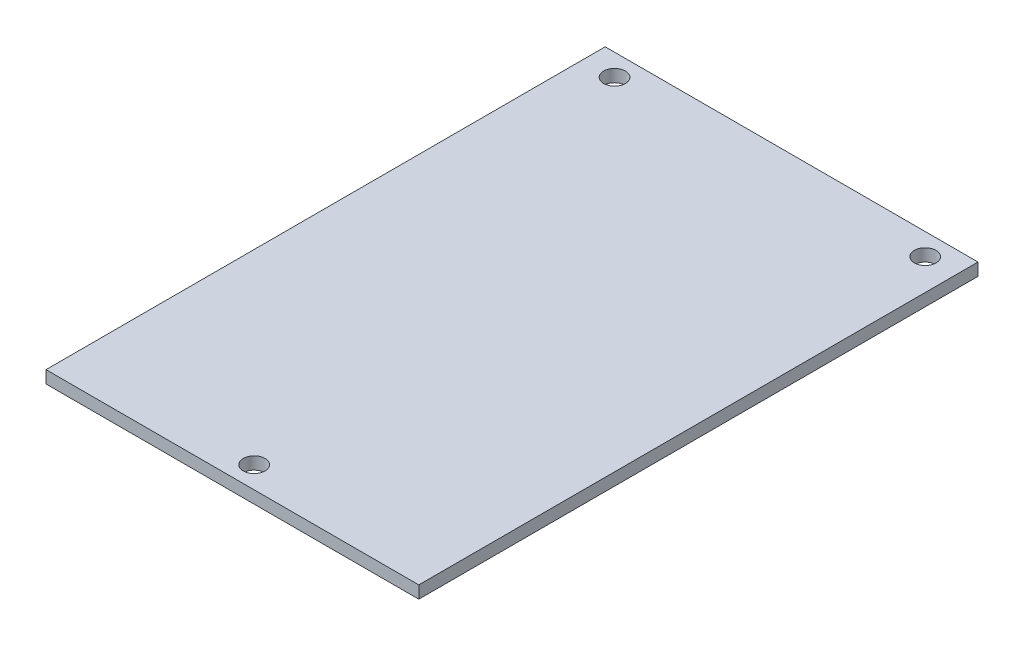
ISO-10303-21;
HEADER;
FILE_DESCRIPTION(('STEP AP214'),'2;1');
FILE_NAME('part.step','',(''),(''),'','','');
FILE_SCHEMA(('AUTOMOTIVE_DESIGN { 1 0 10303 214 1 1 1 1 }'));
ENDSEC;
DATA;
#1=APPLICATION_CONTEXT('core data for automotive mechanical design processes');
#2=APPLICATION_PROTOCOL_DEFINITION('international standard','automotive_design',2000,#1);
#3=PRODUCT_CONTEXT('',#1,'mechanical');
#4=PRODUCT('Part','Part','',(#3));
#5=PRODUCT_RELATED_PRODUCT_CATEGORY('part','',(#4));
#6=PRODUCT_DEFINITION_FORMATION('','',#4);
#7=PRODUCT_DEFINITION_CONTEXT('part definition',#1,'design');
#8=PRODUCT_DEFINITION('design','',#6,#7);
#9=PRODUCT_DEFINITION_SHAPE('','',#8);
#10=(LENGTH_UNIT() NAMED_UNIT(*) SI_UNIT(.MILLI.,.METRE.));
#11=(NAMED_UNIT(*) PLANE_ANGLE_UNIT() SI_UNIT($,.RADIAN.));
#12=(NAMED_UNIT(*) SI_UNIT($,.STERADIAN.) SOLID_ANGLE_UNIT());
#13=UNCERTAINTY_MEASURE_WITH_UNIT(LENGTH_MEASURE(1.E-05),#10,'distance_accuracy_value','');
#14=(GEOMETRIC_REPRESENTATION_CONTEXT(3) GLOBAL_UNCERTAINTY_ASSIGNED_CONTEXT((#13)) GLOBAL_UNIT_ASSIGNED_CONTEXT((#10,
#11,#12)) REPRESENTATION_CONTEXT('',''));
#15=CARTESIAN_POINT('',(0.,0.,0.));
#16=DIRECTION('',(0.,0.,1.));
#17=DIRECTION('',(1.,0.,0.));
#18=AXIS2_PLACEMENT_3D('',#15,#16,#17);
#19=CARTESIAN_POINT('',(30.,2.,-45.));
#20=DIRECTION('',(-1.,0.,0.));
#21=DIRECTION('',(0.,0.,1.));
#22=AXIS2_PLACEMENT_3D('',#19,#20,#21);
#23=PLANE('',#22);
#24=DIRECTION('',(0.,0.,-1.));
#25=VECTOR('',#24,1.);
#26=CARTESIAN_POINT('',(30.,0.,-45.));
#27=LINE('',#26,#25);
#28=CARTESIAN_POINT('',(30.,0.,45.));
#29=VERTEX_POINT('',#28);
#30=CARTESIAN_POINT('',(30.,0.,-45.));
#31=VERTEX_POINT('',#30);
#32=EDGE_CURVE('E96',#29,#31,#27,.T.);
#33=ORIENTED_EDGE('',*,*,#32,.T.);
#34=DIRECTION('',(0.,-1.,0.));
#35=VECTOR('',#34,1.);
#36=CARTESIAN_POINT('',(30.,2.,-45.));
#37=LINE('',#36,#35);
#38=CARTESIAN_POINT('',(30.,2.,-45.));
#39=VERTEX_POINT('',#38);
#40=EDGE_CURVE('E11',#39,#31,#37,.T.);
#41=ORIENTED_EDGE('',*,*,#40,.F.);
#42=DIRECTION('',(0.,0.,-1.));
#43=VECTOR('',#42,1.);
#44=CARTESIAN_POINT('',(30.,2.,-45.));
#45=LINE('',#44,#43);
#46=CARTESIAN_POINT('',(30.,2.,45.));
#47=VERTEX_POINT('',#46);
#48=EDGE_CURVE('E84',#47,#39,#45,.T.);
#49=ORIENTED_EDGE('',*,*,#48,.F.);
#50=DIRECTION('',(0.,-1.,0.));
#51=VECTOR('',#50,1.);
#52=CARTESIAN_POINT('',(30.,2.,45.));
#53=LINE('',#52,#51);
#54=EDGE_CURVE('E92',#47,#29,#53,.T.);
#55=ORIENTED_EDGE('',*,*,#54,.T.);
#56=EDGE_LOOP('',(#33,#41,#49,#55));
#57=FACE_BOUND('',#56,.T.);
#58=ADVANCED_FACE('F33',(#57),#23,.F.);
#59=CARTESIAN_POINT('',(-30.,2.,-45.));
#60=DIRECTION('',(0.,0.,1.));
#61=DIRECTION('',(1.,0.,0.));
#62=AXIS2_PLACEMENT_3D('',#59,#60,#61);
#63=PLANE('',#62);
#64=DIRECTION('',(-1.,0.,0.));
#65=VECTOR('',#64,1.);
#66=CARTESIAN_POINT('',(-30.,0.,-45.));
#67=LINE('',#66,#65);
#68=CARTESIAN_POINT('',(-30.,0.,-45.));
#69=VERTEX_POINT('',#68);
#70=EDGE_CURVE('E88',#31,#69,#67,.T.);
#71=ORIENTED_EDGE('',*,*,#70,.T.);
#72=DIRECTION('',(0.,-1.,0.));
#73=VECTOR('',#72,1.);
#74=CARTESIAN_POINT('',(-30.,2.,-45.));
#75=LINE('',#74,#73);
#76=CARTESIAN_POINT('',(-30.,2.,-45.));
#77=VERTEX_POINT('',#76);
#78=EDGE_CURVE('E41',#77,#69,#75,.T.);
#79=ORIENTED_EDGE('',*,*,#78,.F.);
#80=DIRECTION('',(-1.,0.,0.));
#81=VECTOR('',#80,1.);
#82=CARTESIAN_POINT('',(-30.,2.,-45.));
#83=LINE('',#82,#81);
#84=EDGE_CURVE('E79',#39,#77,#83,.T.);
#85=ORIENTED_EDGE('',*,*,#84,.F.);
#86=ORIENTED_EDGE('',*,*,#40,.T.);
#87=EDGE_LOOP('',(#71,#79,#85,#86));
#88=FACE_BOUND('',#87,.T.);
#89=ADVANCED_FACE('F87',(#88),#63,.F.);
#90=CARTESIAN_POINT('',(-30.,2.,-45.));
#91=DIRECTION('',(1.,0.,0.));
#92=DIRECTION('',(0.,0.,-1.));
#93=AXIS2_PLACEMENT_3D('',#90,#91,#92);
#94=PLANE('',#93);
#95=DIRECTION('',(0.,0.,1.));
#96=VECTOR('',#95,1.);
#97=CARTESIAN_POINT('',(-30.,0.,-45.));
#98=LINE('',#97,#96);
#99=CARTESIAN_POINT('',(-30.,0.,45.));
#100=VERTEX_POINT('',#99);
#101=EDGE_CURVE('E66',#69,#100,#98,.T.);
#102=ORIENTED_EDGE('',*,*,#101,.T.);
#103=DIRECTION('',(0.,-1.,0.));
#104=VECTOR('',#103,1.);
#105=CARTESIAN_POINT('',(-30.,2.,45.));
#106=LINE('',#105,#104);
#107=CARTESIAN_POINT('',(-30.,2.,45.));
#108=VERTEX_POINT('',#107);
#109=EDGE_CURVE('E89',#108,#100,#106,.T.);
#110=ORIENTED_EDGE('',*,*,#109,.F.);
#111=DIRECTION('',(0.,0.,1.));
#112=VECTOR('',#111,1.);
#113=CARTESIAN_POINT('',(-30.,2.,-45.));
#114=LINE('',#113,#112);
#115=EDGE_CURVE('E82',#77,#108,#114,.T.);
#116=ORIENTED_EDGE('',*,*,#115,.F.);
#117=ORIENTED_EDGE('',*,*,#78,.T.);
#118=EDGE_LOOP('',(#102,#110,#116,#117));
#119=FACE_BOUND('',#118,.T.);
#120=ADVANCED_FACE('F90',(#119),#94,.F.);
#121=CARTESIAN_POINT('',(-30.,2.,45.));
#122=DIRECTION('',(0.,0.,-1.));
#123=DIRECTION('',(-1.,0.,0.));
#124=AXIS2_PLACEMENT_3D('',#121,#122,#123);
#125=PLANE('',#124);
#126=DIRECTION('',(1.,0.,0.));
#127=VECTOR('',#126,1.);
#128=CARTESIAN_POINT('',(-30.,0.,45.));
#129=LINE('',#128,#127);
#130=EDGE_CURVE('E72',#100,#29,#129,.T.);
#131=ORIENTED_EDGE('',*,*,#130,.T.);
#132=ORIENTED_EDGE('',*,*,#54,.F.);
#133=DIRECTION('',(1.,0.,0.));
#134=VECTOR('',#133,1.);
#135=CARTESIAN_POINT('',(-30.,2.,45.));
#136=LINE('',#135,#134);
#137=EDGE_CURVE('E49',#108,#47,#136,.T.);
#138=ORIENTED_EDGE('',*,*,#137,.F.);
#139=ORIENTED_EDGE('',*,*,#109,.T.);
#140=EDGE_LOOP('',(#131,#132,#138,#139));
#141=FACE_BOUND('',#140,.T.);
#142=ADVANCED_FACE('F104',(#141),#125,.F.);
#143=CARTESIAN_POINT('',(0.,2.,0.));
#144=DIRECTION('',(0.,1.,0.));
#145=DIRECTION('',(0.,0.,1.));
#146=AXIS2_PLACEMENT_3D('',#143,#144,#145);
#147=PLANE('',#146);
#148=CARTESIAN_POINT('',(-25.,2.,-41.5));
#149=DIRECTION('',(0.,1.,0.));
#150=DIRECTION('',(0.,0.,1.));
#151=AXIS2_PLACEMENT_3D('',#148,#149,#150);
#152=CIRCLE('',#151,1.75);
#153=CARTESIAN_POINT('',(-25.,2.,-39.75));
#154=VERTEX_POINT('',#153);
#155=EDGE_CURVE('E122',#154,#154,#152,.T.);
#156=ORIENTED_EDGE('',*,*,#155,.F.);
#157=EDGE_LOOP('',(#156));
#158=FACE_BOUND('',#157,.T.);
#159=CARTESIAN_POINT('',(25.,2.,-41.5));
#160=DIRECTION('',(0.,1.,0.));
#161=DIRECTION('',(0.,0.,1.));
#162=AXIS2_PLACEMENT_3D('',#159,#160,#161);
#163=CIRCLE('',#162,1.75);
#164=CARTESIAN_POINT('',(25.,2.,-39.75));
#165=VERTEX_POINT('',#164);
#166=EDGE_CURVE('E116',#165,#165,#163,.T.);
#167=ORIENTED_EDGE('',*,*,#166,.F.);
#168=EDGE_LOOP('',(#167));
#169=FACE_BOUND('',#168,.T.);
#170=CARTESIAN_POINT('',(0.,2.,41.5));
#171=DIRECTION('',(0.,1.,0.));
#172=DIRECTION('',(0.,0.,1.));
#173=AXIS2_PLACEMENT_3D('',#170,#171,#172);
#174=CIRCLE('',#173,1.75);
#175=CARTESIAN_POINT('',(0.,2.,43.25));
#176=VERTEX_POINT('',#175);
#177=EDGE_CURVE('E110',#176,#176,#174,.T.);
#178=ORIENTED_EDGE('',*,*,#177,.F.);
#179=EDGE_LOOP('',(#178));
#180=FACE_BOUND('',#179,.T.);
#181=ORIENTED_EDGE('',*,*,#48,.T.);
#182=ORIENTED_EDGE('',*,*,#84,.T.);
#183=ORIENTED_EDGE('',*,*,#115,.T.);
#184=ORIENTED_EDGE('',*,*,#137,.T.);
#185=EDGE_LOOP('',(#181,#182,#183,#184));
#186=FACE_BOUND('',#185,.T.);
#187=ADVANCED_FACE('F80',(#158,#169,#180,#186),#147,.T.);
#188=CARTESIAN_POINT('',(0.,0.,0.));
#189=DIRECTION('',(0.,1.,0.));
#190=DIRECTION('',(0.,0.,1.));
#191=AXIS2_PLACEMENT_3D('',#188,#189,#190);
#192=PLANE('',#191);
#193=CARTESIAN_POINT('',(-25.,0.,-41.5));
#194=DIRECTION('',(0.,1.,0.));
#195=DIRECTION('',(0.,0.,1.));
#196=AXIS2_PLACEMENT_3D('',#193,#194,#195);
#197=CIRCLE('',#196,1.75);
#198=CARTESIAN_POINT('',(-25.,0.,-39.75));
#199=VERTEX_POINT('',#198);
#200=EDGE_CURVE('E99',#199,#199,#197,.T.);
#201=ORIENTED_EDGE('',*,*,#200,.T.);
#202=EDGE_LOOP('',(#201));
#203=FACE_BOUND('',#202,.T.);
#204=CARTESIAN_POINT('',(25.,0.,-41.5));
#205=DIRECTION('',(0.,1.,0.));
#206=DIRECTION('',(0.,0.,1.));
#207=AXIS2_PLACEMENT_3D('',#204,#205,#206);
#208=CIRCLE('',#207,1.75);
#209=CARTESIAN_POINT('',(25.,0.,-39.75));
#210=VERTEX_POINT('',#209);
#211=EDGE_CURVE('E119',#210,#210,#208,.T.);
#212=ORIENTED_EDGE('',*,*,#211,.T.);
#213=EDGE_LOOP('',(#212));
#214=FACE_BOUND('',#213,.T.);
#215=CARTESIAN_POINT('',(0.,0.,41.5));
#216=DIRECTION('',(0.,1.,0.));
#217=DIRECTION('',(0.,0.,1.));
#218=AXIS2_PLACEMENT_3D('',#215,#216,#217);
#219=CIRCLE('',#218,1.75);
#220=CARTESIAN_POINT('',(0.,0.,43.25));
#221=VERTEX_POINT('',#220);
#222=EDGE_CURVE('E113',#221,#221,#219,.T.);
#223=ORIENTED_EDGE('',*,*,#222,.T.);
#224=EDGE_LOOP('',(#223));
#225=FACE_BOUND('',#224,.T.);
#226=ORIENTED_EDGE('',*,*,#32,.F.);
#227=ORIENTED_EDGE('',*,*,#130,.F.);
#228=ORIENTED_EDGE('',*,*,#101,.F.);
#229=ORIENTED_EDGE('',*,*,#70,.F.);
#230=EDGE_LOOP('',(#226,#227,#228,#229));
#231=FACE_BOUND('',#230,.T.);
#232=ADVANCED_FACE('F107',(#203,#214,#225,#231),#192,.F.);
#233=CARTESIAN_POINT('',(0.,0.,41.5));
#234=DIRECTION('',(0.,1.,0.));
#235=DIRECTION('',(0.,0.,1.));
#236=AXIS2_PLACEMENT_3D('',#233,#234,#235);
#237=CYLINDRICAL_SURFACE('',#236,1.75);
#238=ORIENTED_EDGE('',*,*,#222,.F.);
#239=EDGE_LOOP('',(#238));
#240=FACE_BOUND('',#239,.T.);
#241=ORIENTED_EDGE('',*,*,#177,.T.);
#242=EDGE_LOOP('',(#241));
#243=FACE_BOUND('',#242,.T.);
#244=ADVANCED_FACE('F144',(#240,#243),#237,.F.);
#245=CARTESIAN_POINT('',(25.,0.,-41.5));
#246=DIRECTION('',(0.,1.,0.));
#247=DIRECTION('',(0.,0.,1.));
#248=AXIS2_PLACEMENT_3D('',#245,#246,#247);
#249=CYLINDRICAL_SURFACE('',#248,1.75);
#250=ORIENTED_EDGE('',*,*,#211,.F.);
#251=EDGE_LOOP('',(#250));
#252=FACE_BOUND('',#251,.T.);
#253=ORIENTED_EDGE('',*,*,#166,.T.);
#254=EDGE_LOOP('',(#253));
#255=FACE_BOUND('',#254,.T.);
#256=ADVANCED_FACE('F133',(#252,#255),#249,.F.);
#257=CARTESIAN_POINT('',(-25.,0.,-41.5));
#258=DIRECTION('',(0.,1.,0.));
#259=DIRECTION('',(0.,0.,1.));
#260=AXIS2_PLACEMENT_3D('',#257,#258,#259);
#261=CYLINDRICAL_SURFACE('',#260,1.75);
#262=ORIENTED_EDGE('',*,*,#200,.F.);
#263=EDGE_LOOP('',(#262));
#264=FACE_BOUND('',#263,.T.);
#265=ORIENTED_EDGE('',*,*,#155,.T.);
#266=EDGE_LOOP('',(#265));
#267=FACE_BOUND('',#266,.T.);
#268=ADVANCED_FACE('F130',(#264,#267),#261,.F.);
#269=CLOSED_SHELL('',(#58,#89,#120,#142,#187,#232,#244,#256,#268));
#270=MANIFOLD_SOLID_BREP('B2',#269);
#271=ADVANCED_BREP_SHAPE_REPRESENTATION('',(#18,#270),#14);
#272=SHAPE_DEFINITION_REPRESENTATION(#9,#271);
ENDSEC;
END-ISO-10303-21;
